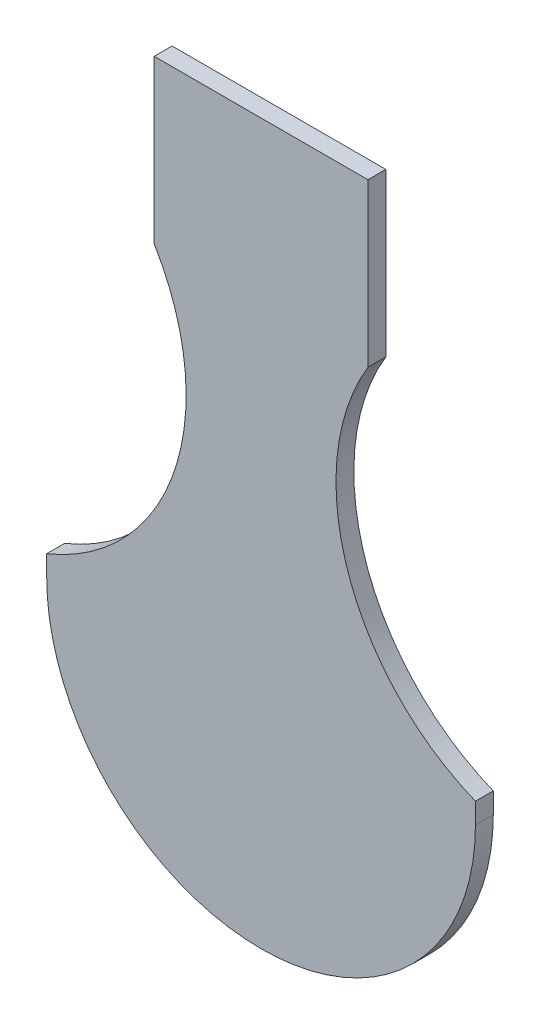
ISO-10303-21;
HEADER;
FILE_DESCRIPTION(('STEP AP214'),'2;1');
FILE_NAME('part.step','',(''),(''),'','','');
FILE_SCHEMA(('AUTOMOTIVE_DESIGN { 1 0 10303 214 1 1 1 1 }'));
ENDSEC;
DATA;
#1=APPLICATION_CONTEXT('core data for automotive mechanical design processes');
#2=APPLICATION_PROTOCOL_DEFINITION('international standard','automotive_design',2000,#1);
#3=PRODUCT_CONTEXT('',#1,'mechanical');
#4=PRODUCT('Part','Part','',(#3));
#5=PRODUCT_RELATED_PRODUCT_CATEGORY('part','',(#4));
#6=PRODUCT_DEFINITION_FORMATION('','',#4);
#7=PRODUCT_DEFINITION_CONTEXT('part definition',#1,'design');
#8=PRODUCT_DEFINITION('design','',#6,#7);
#9=PRODUCT_DEFINITION_SHAPE('','',#8);
#10=(LENGTH_UNIT() NAMED_UNIT(*) SI_UNIT(.MILLI.,.METRE.));
#11=(NAMED_UNIT(*) PLANE_ANGLE_UNIT() SI_UNIT($,.RADIAN.));
#12=(NAMED_UNIT(*) SI_UNIT($,.STERADIAN.) SOLID_ANGLE_UNIT());
#13=UNCERTAINTY_MEASURE_WITH_UNIT(LENGTH_MEASURE(1.E-05),#10,'distance_accuracy_value','');
#14=(GEOMETRIC_REPRESENTATION_CONTEXT(3) GLOBAL_UNCERTAINTY_ASSIGNED_CONTEXT((#13)) GLOBAL_UNIT_ASSIGNED_CONTEXT((#10,
#11,#12)) REPRESENTATION_CONTEXT('',''));
#15=CARTESIAN_POINT('',(0.,0.,0.));
#16=DIRECTION('',(0.,0.,1.));
#17=DIRECTION('',(1.,0.,0.));
#18=AXIS2_PLACEMENT_3D('',#15,#16,#17);
#19=CARTESIAN_POINT('',(-60.,65.777063512519,5.));
#20=DIRECTION('',(1.,0.,0.));
#21=DIRECTION('',(0.,1.,0.));
#22=AXIS2_PLACEMENT_3D('',#19,#20,#21);
#23=PLANE('',#22);
#24=DIRECTION('',(0.,0.,1.));
#25=VECTOR('',#24,1.);
#26=CARTESIAN_POINT('',(-60.,60.,0.));
#27=LINE('',#26,#25);
#28=CARTESIAN_POINT('',(-60.,60.,0.));
#29=VERTEX_POINT('',#28);
#30=CARTESIAN_POINT('',(-60.,60.,5.));
#31=VERTEX_POINT('',#30);
#32=EDGE_CURVE('E163',#29,#31,#27,.T.);
#33=ORIENTED_EDGE('',*,*,#32,.T.);
#34=DIRECTION('',(0.,-1.,0.));
#35=VECTOR('',#34,1.);
#36=CARTESIAN_POINT('',(-60.,65.777063512519,5.));
#37=LINE('',#36,#35);
#38=CARTESIAN_POINT('',(-60.,65.7770635125189,5.));
#39=VERTEX_POINT('',#38);
#40=EDGE_CURVE('E122',#39,#31,#37,.T.);
#41=ORIENTED_EDGE('',*,*,#40,.F.);
#42=DIRECTION('',(0.,0.,-1.));
#43=VECTOR('',#42,1.);
#44=CARTESIAN_POINT('',(-60.,65.7770635125189,5.));
#45=LINE('',#44,#43);
#46=CARTESIAN_POINT('',(-60.,65.7770635125189,0.));
#47=VERTEX_POINT('',#46);
#48=EDGE_CURVE('E118',#39,#47,#45,.T.);
#49=ORIENTED_EDGE('',*,*,#48,.T.);
#50=DIRECTION('',(0.,-1.,0.));
#51=VECTOR('',#50,1.);
#52=CARTESIAN_POINT('',(-60.,65.777063512519,0.));
#53=LINE('',#52,#51);
#54=EDGE_CURVE('E139',#47,#29,#53,.T.);
#55=ORIENTED_EDGE('',*,*,#54,.T.);
#56=EDGE_LOOP('',(#33,#41,#49,#55));
#57=FACE_BOUND('',#56,.T.);
#58=ADVANCED_FACE('F33',(#57),#23,.F.);
#59=CARTESIAN_POINT('',(83.4736078855162,123.701494738359,5.));
#60=DIRECTION('',(0.,0.,-1.));
#61=DIRECTION('',(-1.,0.,0.));
#62=AXIS2_PLACEMENT_3D('',#59,#60,#61);
#63=CYLINDRICAL_SURFACE('',#62,62.5000000000003);
#64=CARTESIAN_POINT('',(83.4736078855162,123.701494738359,0.));
#65=DIRECTION('',(0.,0.,-1.));
#66=DIRECTION('',(-1.,0.,0.));
#67=AXIS2_PLACEMENT_3D('',#64,#65,#66);
#68=CIRCLE('',#67,62.5000000000003);
#69=CARTESIAN_POINT('',(60.,65.7770635125189,0.));
#70=VERTEX_POINT('',#69);
#71=CARTESIAN_POINT('',(29.909652168719,155.906349154565,0.));
#72=VERTEX_POINT('',#71);
#73=EDGE_CURVE('E129',#70,#72,#68,.T.);
#74=ORIENTED_EDGE('',*,*,#73,.T.);
#75=DIRECTION('',(0.,0.,-1.));
#76=VECTOR('',#75,1.);
#77=CARTESIAN_POINT('',(29.909652168719,155.906349154565,5.));
#78=LINE('',#77,#76);
#79=CARTESIAN_POINT('',(29.909652168719,155.906349154565,5.));
#80=VERTEX_POINT('',#79);
#81=EDGE_CURVE('E42',#80,#72,#78,.T.);
#82=ORIENTED_EDGE('',*,*,#81,.F.);
#83=CARTESIAN_POINT('',(83.4736078855162,123.701494738359,5.));
#84=DIRECTION('',(0.,0.,-1.));
#85=DIRECTION('',(-1.,0.,0.));
#86=AXIS2_PLACEMENT_3D('',#83,#84,#85);
#87=CIRCLE('',#86,62.5000000000003);
#88=CARTESIAN_POINT('',(60.,65.7770635125189,5.));
#89=VERTEX_POINT('',#88);
#90=EDGE_CURVE('E143',#89,#80,#87,.T.);
#91=ORIENTED_EDGE('',*,*,#90,.F.);
#92=DIRECTION('',(0.,0.,-1.));
#93=VECTOR('',#92,1.);
#94=CARTESIAN_POINT('',(60.,65.7770635125189,5.));
#95=LINE('',#94,#93);
#96=EDGE_CURVE('E128',#89,#70,#95,.T.);
#97=ORIENTED_EDGE('',*,*,#96,.T.);
#98=EDGE_LOOP('',(#74,#82,#91,#97));
#99=FACE_BOUND('',#98,.T.);
#100=ADVANCED_FACE('F35',(#99),#63,.F.);
#101=CARTESIAN_POINT('',(29.909652168719,155.906349154565,5.));
#102=DIRECTION('',(-0.999999999999993,1.13873610810734E-07,0.));
#103=DIRECTION('',(-1.13873610810734E-07,-0.999999999999994,0.));
#104=AXIS2_PLACEMENT_3D('',#101,#102,#103);
#105=PLANE('',#104);
#106=DIRECTION('',(1.13873610810734E-07,0.999999999999993,0.));
#107=VECTOR('',#106,1.);
#108=CARTESIAN_POINT('',(29.909652168719,155.906349154565,0.));
#109=LINE('',#108,#107);
#110=CARTESIAN_POINT('',(29.9096573488296,201.396349154565,0.));
#111=VERTEX_POINT('',#110);
#112=EDGE_CURVE('E132',#72,#111,#109,.T.);
#113=ORIENTED_EDGE('',*,*,#112,.T.);
#114=DIRECTION('',(0.,0.,-1.));
#115=VECTOR('',#114,1.);
#116=CARTESIAN_POINT('',(29.9096573488296,201.396349154565,5.));
#117=LINE('',#116,#115);
#118=CARTESIAN_POINT('',(29.9096573488296,201.396349154565,5.));
#119=VERTEX_POINT('',#118);
#120=EDGE_CURVE('E147',#119,#111,#117,.T.);
#121=ORIENTED_EDGE('',*,*,#120,.F.);
#122=DIRECTION('',(1.13873610810734E-07,0.999999999999993,0.));
#123=VECTOR('',#122,1.);
#124=CARTESIAN_POINT('',(29.909652168719,155.906349154565,5.));
#125=LINE('',#124,#123);
#126=EDGE_CURVE('E91',#80,#119,#125,.T.);
#127=ORIENTED_EDGE('',*,*,#126,.F.);
#128=ORIENTED_EDGE('',*,*,#81,.T.);
#129=EDGE_LOOP('',(#113,#121,#127,#128));
#130=FACE_BOUND('',#129,.T.);
#131=ADVANCED_FACE('F150',(#130),#105,.F.);
#132=CARTESIAN_POINT('',(-29.9096469886084,201.396349154565,5.));
#133=DIRECTION('',(0.,-1.,0.));
#134=DIRECTION('',(0.,0.,-1.));
#135=AXIS2_PLACEMENT_3D('',#132,#133,#134);
#136=PLANE('',#135);
#137=DIRECTION('',(-1.,0.,0.));
#138=VECTOR('',#137,1.);
#139=CARTESIAN_POINT('',(-29.9096469886084,201.396349154565,0.));
#140=LINE('',#139,#138);
#141=CARTESIAN_POINT('',(-29.9096469886084,201.396349154565,0.));
#142=VERTEX_POINT('',#141);
#143=EDGE_CURVE('E135',#111,#142,#140,.T.);
#144=ORIENTED_EDGE('',*,*,#143,.T.);
#145=DIRECTION('',(0.,0.,-1.));
#146=VECTOR('',#145,1.);
#147=CARTESIAN_POINT('',(-29.9096469886084,201.396349154565,5.));
#148=LINE('',#147,#146);
#149=CARTESIAN_POINT('',(-29.9096469886084,201.396349154565,5.));
#150=VERTEX_POINT('',#149);
#151=EDGE_CURVE('E117',#150,#142,#148,.T.);
#152=ORIENTED_EDGE('',*,*,#151,.F.);
#153=DIRECTION('',(-1.,0.,0.));
#154=VECTOR('',#153,1.);
#155=CARTESIAN_POINT('',(-29.9096469886084,201.396349154565,5.));
#156=LINE('',#155,#154);
#157=EDGE_CURVE('E108',#119,#150,#156,.T.);
#158=ORIENTED_EDGE('',*,*,#157,.F.);
#159=ORIENTED_EDGE('',*,*,#120,.T.);
#160=EDGE_LOOP('',(#144,#152,#158,#159));
#161=FACE_BOUND('',#160,.T.);
#162=ADVANCED_FACE('F159',(#161),#136,.F.);
#163=CARTESIAN_POINT('',(-29.909652168719,155.906349154565,5.));
#164=DIRECTION('',(0.999999999999993,-1.13873611039539E-07,0.));
#165=DIRECTION('',(1.13873611039539E-07,0.999999999999994,0.));
#166=AXIS2_PLACEMENT_3D('',#163,#164,#165);
#167=PLANE('',#166);
#168=DIRECTION('',(-1.13873611039539E-07,-0.999999999999993,0.));
#169=VECTOR('',#168,1.);
#170=CARTESIAN_POINT('',(-29.909652168719,155.906349154565,0.));
#171=LINE('',#170,#169);
#172=CARTESIAN_POINT('',(-29.909652168719,155.906349154565,0.));
#173=VERTEX_POINT('',#172);
#174=EDGE_CURVE('E116',#142,#173,#171,.T.);
#175=ORIENTED_EDGE('',*,*,#174,.T.);
#176=DIRECTION('',(0.,0.,-1.));
#177=VECTOR('',#176,1.);
#178=CARTESIAN_POINT('',(-29.909652168719,155.906349154565,5.));
#179=LINE('',#178,#177);
#180=CARTESIAN_POINT('',(-29.909652168719,155.906349154565,5.));
#181=VERTEX_POINT('',#180);
#182=EDGE_CURVE('E113',#181,#173,#179,.T.);
#183=ORIENTED_EDGE('',*,*,#182,.F.);
#184=DIRECTION('',(-1.13873611039539E-07,-0.999999999999993,0.));
#185=VECTOR('',#184,1.);
#186=CARTESIAN_POINT('',(-29.909652168719,155.906349154565,5.));
#187=LINE('',#186,#185);
#188=EDGE_CURVE('E101',#150,#181,#187,.T.);
#189=ORIENTED_EDGE('',*,*,#188,.F.);
#190=ORIENTED_EDGE('',*,*,#151,.T.);
#191=EDGE_LOOP('',(#175,#183,#189,#190));
#192=FACE_BOUND('',#191,.T.);
#193=ADVANCED_FACE('F114',(#192),#167,.F.);
#194=CARTESIAN_POINT('',(-83.4736078855162,123.701494738359,5.));
#195=DIRECTION('',(0.,0.,-1.));
#196=DIRECTION('',(-1.,0.,0.));
#197=AXIS2_PLACEMENT_3D('',#194,#195,#196);
#198=CYLINDRICAL_SURFACE('',#197,62.5000000000003);
#199=CARTESIAN_POINT('',(-83.4736078855162,123.701494738359,0.));
#200=DIRECTION('',(0.,0.,-1.));
#201=DIRECTION('',(1.,0.,0.));
#202=AXIS2_PLACEMENT_3D('',#199,#200,#201);
#203=CIRCLE('',#202,62.5000000000003);
#204=EDGE_CURVE('E75',#173,#47,#203,.T.);
#205=ORIENTED_EDGE('',*,*,#204,.T.);
#206=ORIENTED_EDGE('',*,*,#48,.F.);
#207=CARTESIAN_POINT('',(-83.4736078855162,123.701494738359,5.));
#208=DIRECTION('',(0.,0.,-1.));
#209=DIRECTION('',(1.,0.,0.));
#210=AXIS2_PLACEMENT_3D('',#207,#208,#209);
#211=CIRCLE('',#210,62.5000000000003);
#212=EDGE_CURVE('E106',#181,#39,#211,.T.);
#213=ORIENTED_EDGE('',*,*,#212,.F.);
#214=ORIENTED_EDGE('',*,*,#182,.T.);
#215=EDGE_LOOP('',(#205,#206,#213,#214));
#216=FACE_BOUND('',#215,.T.);
#217=ADVANCED_FACE('F120',(#216),#198,.F.);
#218=CARTESIAN_POINT('',(60.,65.7770635125189,5.));
#219=DIRECTION('',(-1.,0.,0.));
#220=DIRECTION('',(0.,-1.,0.));
#221=AXIS2_PLACEMENT_3D('',#218,#219,#220);
#222=PLANE('',#221);
#223=DIRECTION('',(0.,1.,0.));
#224=VECTOR('',#223,1.);
#225=CARTESIAN_POINT('',(60.,65.7770635125189,5.));
#226=LINE('',#225,#224);
#227=CARTESIAN_POINT('',(60.,60.,5.));
#228=VERTEX_POINT('',#227);
#229=EDGE_CURVE('E50',#228,#89,#226,.T.);
#230=ORIENTED_EDGE('',*,*,#229,.F.);
#231=DIRECTION('',(0.,0.,1.));
#232=VECTOR('',#231,1.);
#233=CARTESIAN_POINT('',(60.,60.,0.));
#234=LINE('',#233,#232);
#235=CARTESIAN_POINT('',(60.,60.,0.));
#236=VERTEX_POINT('',#235);
#237=EDGE_CURVE('E133',#236,#228,#234,.T.);
#238=ORIENTED_EDGE('',*,*,#237,.F.);
#239=DIRECTION('',(0.,1.,0.));
#240=VECTOR('',#239,1.);
#241=CARTESIAN_POINT('',(60.,65.7770635125189,0.));
#242=LINE('',#241,#240);
#243=EDGE_CURVE('E82',#236,#70,#242,.T.);
#244=ORIENTED_EDGE('',*,*,#243,.T.);
#245=ORIENTED_EDGE('',*,*,#96,.F.);
#246=EDGE_LOOP('',(#230,#238,#244,#245));
#247=FACE_BOUND('',#246,.T.);
#248=ADVANCED_FACE('F179',(#247),#222,.F.);
#249=CARTESIAN_POINT('',(83.4736078855162,123.701494738359,5.));
#250=DIRECTION('',(0.,0.,-1.));
#251=DIRECTION('',(-1.,0.,0.));
#252=AXIS2_PLACEMENT_3D('',#249,#250,#251);
#253=PLANE('',#252);
#254=ORIENTED_EDGE('',*,*,#40,.T.);
#255=CARTESIAN_POINT('',(0.,60.,5.));
#256=DIRECTION('',(0.,0.,-1.));
#257=DIRECTION('',(-1.,0.,0.));
#258=AXIS2_PLACEMENT_3D('',#255,#256,#257);
#259=CIRCLE('',#258,60.);
#260=EDGE_CURVE('E166',#228,#31,#259,.T.);
#261=ORIENTED_EDGE('',*,*,#260,.F.);
#262=ORIENTED_EDGE('',*,*,#229,.T.);
#263=ORIENTED_EDGE('',*,*,#90,.T.);
#264=ORIENTED_EDGE('',*,*,#126,.T.);
#265=ORIENTED_EDGE('',*,*,#157,.T.);
#266=ORIENTED_EDGE('',*,*,#188,.T.);
#267=ORIENTED_EDGE('',*,*,#212,.T.);
#268=EDGE_LOOP('',(#254,#261,#262,#263,#264,#265,#266,#267));
#269=FACE_BOUND('',#268,.T.);
#270=ADVANCED_FACE('F104',(#269),#253,.F.);
#271=CARTESIAN_POINT('',(83.4736078855162,123.701494738359,0.));
#272=DIRECTION('',(0.,0.,-1.));
#273=DIRECTION('',(-1.,0.,0.));
#274=AXIS2_PLACEMENT_3D('',#271,#272,#273);
#275=PLANE('',#274);
#276=CARTESIAN_POINT('',(0.,60.,0.));
#277=DIRECTION('',(0.,0.,-1.));
#278=DIRECTION('',(-1.,0.,0.));
#279=AXIS2_PLACEMENT_3D('',#276,#277,#278);
#280=CIRCLE('',#279,60.);
#281=EDGE_CURVE('E11',#29,#236,#280,.F.);
#282=ORIENTED_EDGE('',*,*,#281,.F.);
#283=ORIENTED_EDGE('',*,*,#54,.F.);
#284=ORIENTED_EDGE('',*,*,#204,.F.);
#285=ORIENTED_EDGE('',*,*,#174,.F.);
#286=ORIENTED_EDGE('',*,*,#143,.F.);
#287=ORIENTED_EDGE('',*,*,#112,.F.);
#288=ORIENTED_EDGE('',*,*,#73,.F.);
#289=ORIENTED_EDGE('',*,*,#243,.F.);
#290=EDGE_LOOP('',(#282,#283,#284,#285,#286,#287,#288,#289));
#291=FACE_BOUND('',#290,.T.);
#292=ADVANCED_FACE('F156',(#291),#275,.T.);
#293=CARTESIAN_POINT('',(0.,60.,0.));
#294=DIRECTION('',(0.,0.,1.));
#295=DIRECTION('',(1.,0.,0.));
#296=AXIS2_PLACEMENT_3D('',#293,#294,#295);
#297=CYLINDRICAL_SURFACE('',#296,60.);
#298=ORIENTED_EDGE('',*,*,#260,.T.);
#299=ORIENTED_EDGE('',*,*,#32,.F.);
#300=ORIENTED_EDGE('',*,*,#281,.T.);
#301=ORIENTED_EDGE('',*,*,#237,.T.);
#302=EDGE_LOOP('',(#298,#299,#300,#301));
#303=FACE_BOUND('',#302,.T.);
#304=ADVANCED_FACE('F173',(#303),#297,.T.);
#305=CLOSED_SHELL('',(#58,#100,#131,#162,#193,#217,#248,#270,#292,#304));
#306=MANIFOLD_SOLID_BREP('B2',#305);
#307=ADVANCED_BREP_SHAPE_REPRESENTATION('',(#18,#306),#14);
#308=SHAPE_DEFINITION_REPRESENTATION(#9,#307);
ENDSEC;
END-ISO-10303-21;
